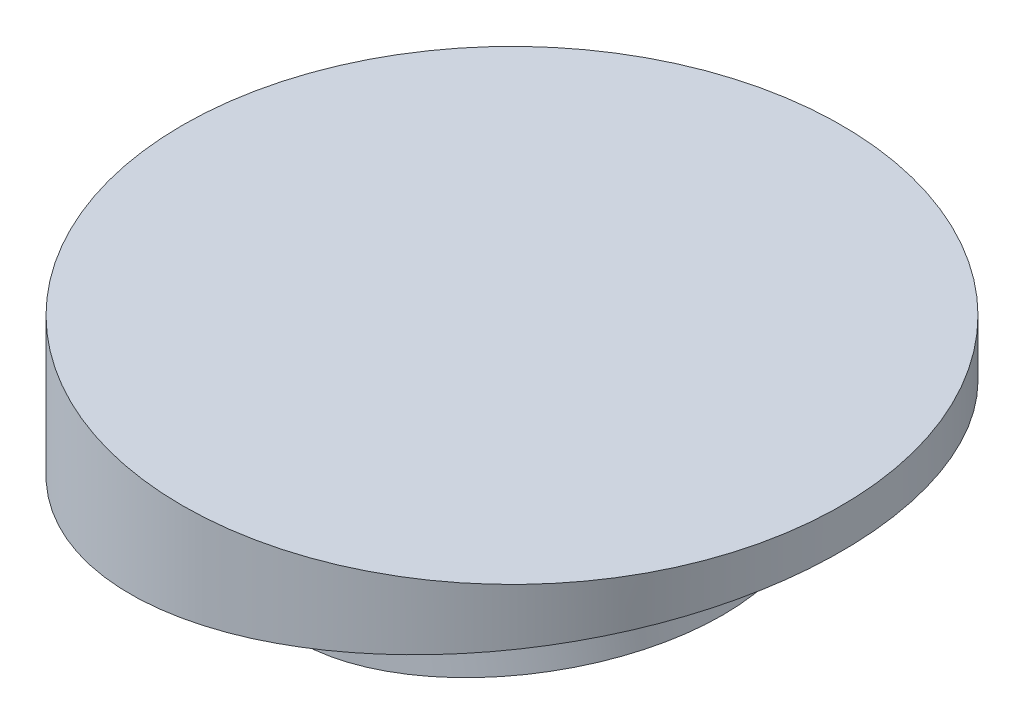
ISO-10303-21;
HEADER;
FILE_DESCRIPTION(('STEP AP214'),'2;1');
FILE_NAME('part.step','',(''),(''),'','','');
FILE_SCHEMA(('AUTOMOTIVE_DESIGN { 1 0 10303 214 1 1 1 1 }'));
ENDSEC;
DATA;
#1=APPLICATION_CONTEXT('core data for automotive mechanical design processes');
#2=APPLICATION_PROTOCOL_DEFINITION('international standard','automotive_design',2000,#1);
#3=PRODUCT_CONTEXT('',#1,'mechanical');
#4=PRODUCT('Part','Part','',(#3));
#5=PRODUCT_RELATED_PRODUCT_CATEGORY('part','',(#4));
#6=PRODUCT_DEFINITION_FORMATION('','',#4);
#7=PRODUCT_DEFINITION_CONTEXT('part definition',#1,'design');
#8=PRODUCT_DEFINITION('design','',#6,#7);
#9=PRODUCT_DEFINITION_SHAPE('','',#8);
#10=(LENGTH_UNIT() NAMED_UNIT(*) SI_UNIT(.MILLI.,.METRE.));
#11=(NAMED_UNIT(*) PLANE_ANGLE_UNIT() SI_UNIT($,.RADIAN.));
#12=(NAMED_UNIT(*) SI_UNIT($,.STERADIAN.) SOLID_ANGLE_UNIT());
#13=UNCERTAINTY_MEASURE_WITH_UNIT(LENGTH_MEASURE(1.E-05),#10,'distance_accuracy_value','');
#14=(GEOMETRIC_REPRESENTATION_CONTEXT(3) GLOBAL_UNCERTAINTY_ASSIGNED_CONTEXT((#13)) GLOBAL_UNIT_ASSIGNED_CONTEXT((#10,
#11,#12)) REPRESENTATION_CONTEXT('',''));
#15=CARTESIAN_POINT('',(0.,0.,0.));
#16=DIRECTION('',(0.,0.,1.));
#17=DIRECTION('',(1.,0.,0.));
#18=AXIS2_PLACEMENT_3D('',#15,#16,#17);
#19=CARTESIAN_POINT('',(0.,20.,0.));
#20=DIRECTION('',(0.,-1.,0.));
#21=DIRECTION('',(0.,0.,-1.));
#22=AXIS2_PLACEMENT_3D('',#19,#20,#21);
#23=CYLINDRICAL_SURFACE('',#22,25.);
#24=CARTESIAN_POINT('',(0.,20.,0.));
#25=DIRECTION('',(0.,1.,0.));
#26=DIRECTION('',(0.,0.,1.));
#27=AXIS2_PLACEMENT_3D('',#24,#25,#26);
#28=CIRCLE('',#27,25.);
#29=CARTESIAN_POINT('',(0.,20.,25.));
#30=VERTEX_POINT('',#29);
#31=EDGE_CURVE('E48',#30,#30,#28,.T.);
#32=ORIENTED_EDGE('',*,*,#31,.F.);
#33=EDGE_LOOP('',(#32));
#34=FACE_BOUND('',#33,.T.);
#35=CARTESIAN_POINT('',(0.,12.5918254822884,0.));
#36=DIRECTION('',(-0.173648177666931,0.984807753012208,0.));
#37=DIRECTION('',(-0.984807753012208,-0.173648177666931,0.));
#38=AXIS2_PLACEMENT_3D('',#35,#36,#37);
#39=ELLIPSE('',#38,25.3856652971436,25.);
#40=CARTESIAN_POINT('',(-25.,8.1836509645767,0.));
#41=VERTEX_POINT('',#40);
#42=EDGE_CURVE('E40',#41,#41,#39,.T.);
#43=ORIENTED_EDGE('',*,*,#42,.T.);
#44=EDGE_LOOP('',(#43));
#45=FACE_BOUND('',#44,.T.);
#46=ADVANCED_FACE('F37',(#34,#45),#23,.T.);
#47=CARTESIAN_POINT('',(0.,20.,0.));
#48=DIRECTION('',(0.,1.,0.));
#49=DIRECTION('',(0.,0.,1.));
#50=AXIS2_PLACEMENT_3D('',#47,#48,#49);
#51=PLANE('',#50);
#52=ORIENTED_EDGE('',*,*,#31,.T.);
#53=EDGE_LOOP('',(#52));
#54=FACE_BOUND('',#53,.T.);
#55=ADVANCED_FACE('F68',(#54),#51,.T.);
#56=CARTESIAN_POINT('',(-25.,8.1836509645767,-41.));
#57=DIRECTION('',(-0.173648177666931,0.984807753012208,0.));
#58=DIRECTION('',(-0.984807753012208,-0.173648177666931,0.));
#59=AXIS2_PLACEMENT_3D('',#56,#57,#58);
#60=PLANE('',#59);
#61=CARTESIAN_POINT('',(0.,12.5918254822884,0.));
#62=DIRECTION('',(0.173648177666931,-0.984807753012208,0.));
#63=DIRECTION('',(0.984807753012208,0.173648177666931,0.));
#64=AXIS2_PLACEMENT_3D('',#61,#62,#63);
#65=CIRCLE('',#64,15.);
#66=CARTESIAN_POINT('',(14.7721162951831,15.1965481472923,0.));
#67=VERTEX_POINT('',#66);
#68=EDGE_CURVE('E10',#67,#67,#65,.T.);
#69=ORIENTED_EDGE('',*,*,#68,.F.);
#70=EDGE_LOOP('',(#69));
#71=FACE_BOUND('',#70,.T.);
#72=ORIENTED_EDGE('',*,*,#42,.F.);
#73=EDGE_LOOP('',(#72));
#74=FACE_BOUND('',#73,.T.);
#75=ADVANCED_FACE('F61',(#71,#74),#60,.F.);
#76=CARTESIAN_POINT('',(1.21553724366852,5.6981712112029,0.));
#77=DIRECTION('',(-0.173648177666931,0.984807753012208,0.));
#78=DIRECTION('',(-0.984807753012208,-0.173648177666931,0.));
#79=AXIS2_PLACEMENT_3D('',#76,#77,#78);
#80=CYLINDRICAL_SURFACE('',#79,15.);
#81=CARTESIAN_POINT('',(1.21553724366852,5.6981712112029,0.));
#82=DIRECTION('',(0.173648177666931,-0.984807753012208,0.));
#83=DIRECTION('',(0.984807753012208,0.173648177666931,0.));
#84=AXIS2_PLACEMENT_3D('',#81,#82,#83);
#85=CIRCLE('',#84,15.);
#86=CARTESIAN_POINT('',(15.9876535388516,8.30289387620687,0.));
#87=VERTEX_POINT('',#86);
#88=EDGE_CURVE('E50',#87,#87,#85,.T.);
#89=ORIENTED_EDGE('',*,*,#88,.F.);
#90=EDGE_LOOP('',(#89));
#91=FACE_BOUND('',#90,.T.);
#92=ORIENTED_EDGE('',*,*,#68,.T.);
#93=EDGE_LOOP('',(#92));
#94=FACE_BOUND('',#93,.T.);
#95=ADVANCED_FACE('F59',(#91,#94),#80,.T.);
#96=CARTESIAN_POINT('',(1.21553724366852,5.6981712112029,0.));
#97=DIRECTION('',(0.173648177666931,-0.984807753012208,0.));
#98=DIRECTION('',(0.984807753012208,0.173648177666931,0.));
#99=AXIS2_PLACEMENT_3D('',#96,#97,#98);
#100=PLANE('',#99);
#101=ORIENTED_EDGE('',*,*,#88,.T.);
#102=EDGE_LOOP('',(#101));
#103=FACE_BOUND('',#102,.T.);
#104=ADVANCED_FACE('F57',(#103),#100,.T.);
#105=CLOSED_SHELL('',(#46,#55,#75,#95,#104));
#106=MANIFOLD_SOLID_BREP('B2',#105);
#107=ADVANCED_BREP_SHAPE_REPRESENTATION('',(#18,#106),#14);
#108=SHAPE_DEFINITION_REPRESENTATION(#9,#107);
ENDSEC;
END-ISO-10303-21;
